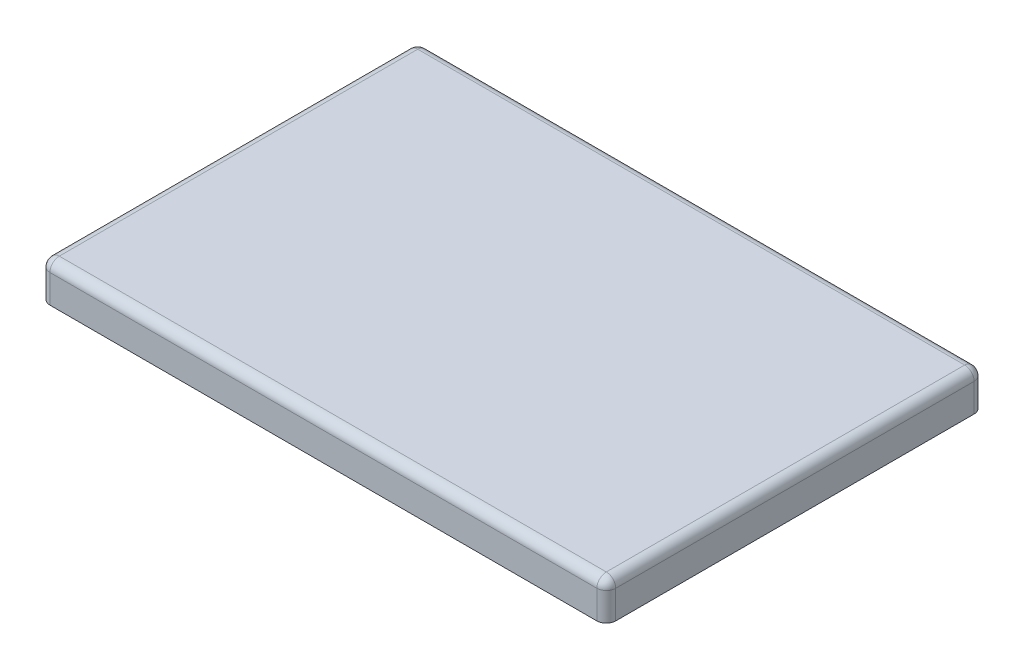
ISO-10303-21;
HEADER;
FILE_DESCRIPTION(('STEP AP214'),'2;1');
FILE_NAME('part.step','',(''),(''),'','','');
FILE_SCHEMA(('AUTOMOTIVE_DESIGN { 1 0 10303 214 1 1 1 1 }'));
ENDSEC;
DATA;
#1=APPLICATION_CONTEXT('core data for automotive mechanical design processes');
#2=APPLICATION_PROTOCOL_DEFINITION('international standard','automotive_design',2000,#1);
#3=PRODUCT_CONTEXT('',#1,'mechanical');
#4=PRODUCT('Part','Part','',(#3));
#5=PRODUCT_RELATED_PRODUCT_CATEGORY('part','',(#4));
#6=PRODUCT_DEFINITION_FORMATION('','',#4);
#7=PRODUCT_DEFINITION_CONTEXT('part definition',#1,'design');
#8=PRODUCT_DEFINITION('design','',#6,#7);
#9=PRODUCT_DEFINITION_SHAPE('','',#8);
#10=(LENGTH_UNIT() NAMED_UNIT(*) SI_UNIT(.MILLI.,.METRE.));
#11=(NAMED_UNIT(*) PLANE_ANGLE_UNIT() SI_UNIT($,.RADIAN.));
#12=(NAMED_UNIT(*) SI_UNIT($,.STERADIAN.) SOLID_ANGLE_UNIT());
#13=UNCERTAINTY_MEASURE_WITH_UNIT(LENGTH_MEASURE(1.E-05),#10,'distance_accuracy_value','');
#14=(GEOMETRIC_REPRESENTATION_CONTEXT(3) GLOBAL_UNCERTAINTY_ASSIGNED_CONTEXT((#13)) GLOBAL_UNIT_ASSIGNED_CONTEXT((#10,
#11,#12)) REPRESENTATION_CONTEXT('',''));
#15=CARTESIAN_POINT('',(0.,0.,0.));
#16=DIRECTION('',(0.,0.,1.));
#17=DIRECTION('',(1.,0.,0.));
#18=AXIS2_PLACEMENT_3D('',#15,#16,#17);
#19=CARTESIAN_POINT('',(-72.5,10.,47.5));
#20=DIRECTION('',(0.,-1.,0.));
#21=DIRECTION('',(0.,0.,-1.));
#22=AXIS2_PLACEMENT_3D('',#19,#20,#21);
#23=CYLINDRICAL_SURFACE('',#22,2.5);
#24=DIRECTION('',(0.,-1.,0.));
#25=VECTOR('',#24,1.);
#26=CARTESIAN_POINT('',(-72.5,10.,50.));
#27=LINE('',#26,#25);
#28=CARTESIAN_POINT('',(-72.5,7.5,50.));
#29=VERTEX_POINT('',#28);
#30=CARTESIAN_POINT('',(-72.5,0.,50.));
#31=VERTEX_POINT('',#30);
#32=EDGE_CURVE('E253',#29,#31,#27,.T.);
#33=ORIENTED_EDGE('',*,*,#32,.F.);
#34=CARTESIAN_POINT('',(-72.5,7.5,47.5));
#35=DIRECTION('',(0.,-1.,0.));
#36=DIRECTION('',(0.,0.,-1.));
#37=AXIS2_PLACEMENT_3D('',#34,#35,#36);
#38=CIRCLE('',#37,2.5);
#39=CARTESIAN_POINT('',(-75.,7.5,47.5));
#40=VERTEX_POINT('',#39);
#41=EDGE_CURVE('E279',#29,#40,#38,.T.);
#42=ORIENTED_EDGE('',*,*,#41,.T.);
#43=DIRECTION('',(0.,-1.,0.));
#44=VECTOR('',#43,1.);
#45=CARTESIAN_POINT('',(-75.,10.,47.5));
#46=LINE('',#45,#44);
#47=CARTESIAN_POINT('',(-75.,0.,47.5));
#48=VERTEX_POINT('',#47);
#49=EDGE_CURVE('E238',#40,#48,#46,.T.);
#50=ORIENTED_EDGE('',*,*,#49,.T.);
#51=CARTESIAN_POINT('',(-72.5,0.,47.5));
#52=DIRECTION('',(0.,1.,0.));
#53=DIRECTION('',(0.,0.,-1.));
#54=AXIS2_PLACEMENT_3D('',#51,#52,#53);
#55=CIRCLE('',#54,2.5);
#56=EDGE_CURVE('E186',#48,#31,#55,.T.);
#57=ORIENTED_EDGE('',*,*,#56,.T.);
#58=EDGE_LOOP('',(#33,#42,#50,#57));
#59=FACE_BOUND('',#58,.T.);
#60=ADVANCED_FACE('F33',(#59),#23,.T.);
#61=CARTESIAN_POINT('',(-72.5,10.,50.));
#62=DIRECTION('',(0.,0.,-1.));
#63=DIRECTION('',(-1.,0.,0.));
#64=AXIS2_PLACEMENT_3D('',#61,#62,#63);
#65=PLANE('',#64);
#66=DIRECTION('',(0.,-1.,0.));
#67=VECTOR('',#66,1.);
#68=CARTESIAN_POINT('',(72.5,10.,50.));
#69=LINE('',#68,#67);
#70=CARTESIAN_POINT('',(72.5,7.5,50.));
#71=VERTEX_POINT('',#70);
#72=CARTESIAN_POINT('',(72.5,0.,50.));
#73=VERTEX_POINT('',#72);
#74=EDGE_CURVE('E251',#71,#73,#69,.T.);
#75=ORIENTED_EDGE('',*,*,#74,.F.);
#76=DIRECTION('',(1.,0.,0.));
#77=VECTOR('',#76,1.);
#78=CARTESIAN_POINT('',(-72.5,7.5,50.));
#79=LINE('',#78,#77);
#80=EDGE_CURVE('E277',#71,#29,#79,.F.);
#81=ORIENTED_EDGE('',*,*,#80,.T.);
#82=ORIENTED_EDGE('',*,*,#32,.T.);
#83=DIRECTION('',(1.,0.,0.));
#84=VECTOR('',#83,1.);
#85=CARTESIAN_POINT('',(-72.5,0.,50.));
#86=LINE('',#85,#84);
#87=EDGE_CURVE('E190',#31,#73,#86,.T.);
#88=ORIENTED_EDGE('',*,*,#87,.T.);
#89=EDGE_LOOP('',(#75,#81,#82,#88));
#90=FACE_BOUND('',#89,.T.);
#91=ADVANCED_FACE('F439',(#90),#65,.F.);
#92=CARTESIAN_POINT('',(72.5,10.,47.5));
#93=DIRECTION('',(0.,-1.,0.));
#94=DIRECTION('',(0.,0.,-1.));
#95=AXIS2_PLACEMENT_3D('',#92,#93,#94);
#96=CYLINDRICAL_SURFACE('',#95,2.5);
#97=DIRECTION('',(0.,-1.,0.));
#98=VECTOR('',#97,1.);
#99=CARTESIAN_POINT('',(75.,10.,47.5));
#100=LINE('',#99,#98);
#101=CARTESIAN_POINT('',(75.,7.5,47.5));
#102=VERTEX_POINT('',#101);
#103=CARTESIAN_POINT('',(75.,0.,47.5));
#104=VERTEX_POINT('',#103);
#105=EDGE_CURVE('E249',#102,#104,#100,.T.);
#106=ORIENTED_EDGE('',*,*,#105,.F.);
#107=CARTESIAN_POINT('',(72.5,7.5,47.5));
#108=DIRECTION('',(0.,-1.,0.));
#109=DIRECTION('',(0.,0.,-1.));
#110=AXIS2_PLACEMENT_3D('',#107,#108,#109);
#111=CIRCLE('',#110,2.5);
#112=EDGE_CURVE('E275',#102,#71,#111,.T.);
#113=ORIENTED_EDGE('',*,*,#112,.T.);
#114=ORIENTED_EDGE('',*,*,#74,.T.);
#115=CARTESIAN_POINT('',(72.5,0.,47.5));
#116=DIRECTION('',(0.,1.,0.));
#117=DIRECTION('',(0.,0.,1.));
#118=AXIS2_PLACEMENT_3D('',#115,#116,#117);
#119=CIRCLE('',#118,2.5);
#120=EDGE_CURVE('E220',#73,#104,#119,.T.);
#121=ORIENTED_EDGE('',*,*,#120,.T.);
#122=EDGE_LOOP('',(#106,#113,#114,#121));
#123=FACE_BOUND('',#122,.T.);
#124=ADVANCED_FACE('F386',(#123),#96,.T.);
#125=CARTESIAN_POINT('',(75.,10.,47.5));
#126=DIRECTION('',(-1.,0.,0.));
#127=DIRECTION('',(0.,0.,1.));
#128=AXIS2_PLACEMENT_3D('',#125,#126,#127);
#129=PLANE('',#128);
#130=DIRECTION('',(0.,-1.,0.));
#131=VECTOR('',#130,1.);
#132=CARTESIAN_POINT('',(75.,10.,-47.5));
#133=LINE('',#132,#131);
#134=CARTESIAN_POINT('',(75.,7.5,-47.5));
#135=VERTEX_POINT('',#134);
#136=CARTESIAN_POINT('',(75.,0.,-47.5));
#137=VERTEX_POINT('',#136);
#138=EDGE_CURVE('E247',#135,#137,#133,.T.);
#139=ORIENTED_EDGE('',*,*,#138,.F.);
#140=DIRECTION('',(0.,0.,-1.));
#141=VECTOR('',#140,1.);
#142=CARTESIAN_POINT('',(75.,7.5,47.5));
#143=LINE('',#142,#141);
#144=EDGE_CURVE('E273',#135,#102,#143,.F.);
#145=ORIENTED_EDGE('',*,*,#144,.T.);
#146=ORIENTED_EDGE('',*,*,#105,.T.);
#147=DIRECTION('',(0.,0.,-1.));
#148=VECTOR('',#147,1.);
#149=CARTESIAN_POINT('',(75.,0.,47.5));
#150=LINE('',#149,#148);
#151=EDGE_CURVE('E223',#104,#137,#150,.T.);
#152=ORIENTED_EDGE('',*,*,#151,.T.);
#153=EDGE_LOOP('',(#139,#145,#146,#152));
#154=FACE_BOUND('',#153,.T.);
#155=ADVANCED_FACE('F382',(#154),#129,.F.);
#156=CARTESIAN_POINT('',(72.5,10.,-47.5));
#157=DIRECTION('',(0.,-1.,0.));
#158=DIRECTION('',(0.,0.,-1.));
#159=AXIS2_PLACEMENT_3D('',#156,#157,#158);
#160=CYLINDRICAL_SURFACE('',#159,2.5);
#161=DIRECTION('',(0.,-1.,0.));
#162=VECTOR('',#161,1.);
#163=CARTESIAN_POINT('',(72.5,10.,-50.));
#164=LINE('',#163,#162);
#165=CARTESIAN_POINT('',(72.5,7.5,-50.));
#166=VERTEX_POINT('',#165);
#167=CARTESIAN_POINT('',(72.5,0.,-50.));
#168=VERTEX_POINT('',#167);
#169=EDGE_CURVE('E245',#166,#168,#164,.T.);
#170=ORIENTED_EDGE('',*,*,#169,.F.);
#171=CARTESIAN_POINT('',(72.5,7.5,-47.5));
#172=DIRECTION('',(0.,-1.,0.));
#173=DIRECTION('',(0.,0.,-1.));
#174=AXIS2_PLACEMENT_3D('',#171,#172,#173);
#175=CIRCLE('',#174,2.5);
#176=EDGE_CURVE('E271',#166,#135,#175,.T.);
#177=ORIENTED_EDGE('',*,*,#176,.T.);
#178=ORIENTED_EDGE('',*,*,#138,.T.);
#179=CARTESIAN_POINT('',(72.5,0.,-47.5));
#180=DIRECTION('',(0.,1.,0.));
#181=DIRECTION('',(0.,0.,-1.));
#182=AXIS2_PLACEMENT_3D('',#179,#180,#181);
#183=CIRCLE('',#182,2.5);
#184=EDGE_CURVE('E226',#137,#168,#183,.T.);
#185=ORIENTED_EDGE('',*,*,#184,.T.);
#186=EDGE_LOOP('',(#170,#177,#178,#185));
#187=FACE_BOUND('',#186,.T.);
#188=ADVANCED_FACE('F378',(#187),#160,.T.);
#189=CARTESIAN_POINT('',(-72.5,10.,-50.));
#190=DIRECTION('',(0.,0.,1.));
#191=DIRECTION('',(1.,0.,0.));
#192=AXIS2_PLACEMENT_3D('',#189,#190,#191);
#193=PLANE('',#192);
#194=DIRECTION('',(0.,-1.,0.));
#195=VECTOR('',#194,1.);
#196=CARTESIAN_POINT('',(-72.5,10.,-50.));
#197=LINE('',#196,#195);
#198=CARTESIAN_POINT('',(-72.5,7.5,-50.));
#199=VERTEX_POINT('',#198);
#200=CARTESIAN_POINT('',(-72.5,0.,-50.));
#201=VERTEX_POINT('',#200);
#202=EDGE_CURVE('E243',#199,#201,#197,.T.);
#203=ORIENTED_EDGE('',*,*,#202,.F.);
#204=DIRECTION('',(-1.,0.,0.));
#205=VECTOR('',#204,1.);
#206=CARTESIAN_POINT('',(-72.5,7.5,-50.));
#207=LINE('',#206,#205);
#208=EDGE_CURVE('E269',#199,#166,#207,.F.);
#209=ORIENTED_EDGE('',*,*,#208,.T.);
#210=ORIENTED_EDGE('',*,*,#169,.T.);
#211=DIRECTION('',(-1.,0.,0.));
#212=VECTOR('',#211,1.);
#213=CARTESIAN_POINT('',(-72.5,0.,-50.));
#214=LINE('',#213,#212);
#215=EDGE_CURVE('E229',#168,#201,#214,.T.);
#216=ORIENTED_EDGE('',*,*,#215,.T.);
#217=EDGE_LOOP('',(#203,#209,#210,#216));
#218=FACE_BOUND('',#217,.T.);
#219=ADVANCED_FACE('F374',(#218),#193,.F.);
#220=CARTESIAN_POINT('',(-72.5,10.,-47.5));
#221=DIRECTION('',(0.,-1.,0.));
#222=DIRECTION('',(0.,0.,-1.));
#223=AXIS2_PLACEMENT_3D('',#220,#221,#222);
#224=CYLINDRICAL_SURFACE('',#223,2.5);
#225=DIRECTION('',(0.,-1.,0.));
#226=VECTOR('',#225,1.);
#227=CARTESIAN_POINT('',(-75.,10.,-47.5));
#228=LINE('',#227,#226);
#229=CARTESIAN_POINT('',(-75.,7.5,-47.5));
#230=VERTEX_POINT('',#229);
#231=CARTESIAN_POINT('',(-75.,0.,-47.5));
#232=VERTEX_POINT('',#231);
#233=EDGE_CURVE('E241',#230,#232,#228,.T.);
#234=ORIENTED_EDGE('',*,*,#233,.F.);
#235=CARTESIAN_POINT('',(-72.5,7.5,-47.5));
#236=DIRECTION('',(0.,-1.,0.));
#237=DIRECTION('',(0.,0.,-1.));
#238=AXIS2_PLACEMENT_3D('',#235,#236,#237);
#239=CIRCLE('',#238,2.5);
#240=EDGE_CURVE('E267',#230,#199,#239,.T.);
#241=ORIENTED_EDGE('',*,*,#240,.T.);
#242=ORIENTED_EDGE('',*,*,#202,.T.);
#243=CARTESIAN_POINT('',(-72.5,0.,-47.5));
#244=DIRECTION('',(0.,1.,0.));
#245=DIRECTION('',(0.,0.,-1.));
#246=AXIS2_PLACEMENT_3D('',#243,#244,#245);
#247=CIRCLE('',#246,2.5);
#248=EDGE_CURVE('E232',#201,#232,#247,.T.);
#249=ORIENTED_EDGE('',*,*,#248,.T.);
#250=EDGE_LOOP('',(#234,#241,#242,#249));
#251=FACE_BOUND('',#250,.T.);
#252=ADVANCED_FACE('F369',(#251),#224,.T.);
#253=CARTESIAN_POINT('',(-75.,10.,47.5));
#254=DIRECTION('',(1.,0.,0.));
#255=DIRECTION('',(0.,0.,-1.));
#256=AXIS2_PLACEMENT_3D('',#253,#254,#255);
#257=PLANE('',#256);
#258=ORIENTED_EDGE('',*,*,#49,.F.);
#259=DIRECTION('',(0.,0.,1.));
#260=VECTOR('',#259,1.);
#261=CARTESIAN_POINT('',(-75.,7.5,47.5));
#262=LINE('',#261,#260);
#263=EDGE_CURVE('E264',#40,#230,#262,.F.);
#264=ORIENTED_EDGE('',*,*,#263,.T.);
#265=ORIENTED_EDGE('',*,*,#233,.T.);
#266=DIRECTION('',(0.,0.,1.));
#267=VECTOR('',#266,1.);
#268=CARTESIAN_POINT('',(-75.,0.,47.5));
#269=LINE('',#268,#267);
#270=EDGE_CURVE('E235',#232,#48,#269,.T.);
#271=ORIENTED_EDGE('',*,*,#270,.T.);
#272=EDGE_LOOP('',(#258,#264,#265,#271));
#273=FACE_BOUND('',#272,.T.);
#274=ADVANCED_FACE('F404',(#273),#257,.F.);
#275=CARTESIAN_POINT('',(-72.5,10.,47.5));
#276=DIRECTION('',(0.,-1.,0.));
#277=DIRECTION('',(0.,0.,-1.));
#278=AXIS2_PLACEMENT_3D('',#275,#276,#277);
#279=PLANE('',#278);
#280=DIRECTION('',(-1.,0.,0.));
#281=VECTOR('',#280,1.);
#282=CARTESIAN_POINT('',(-72.5,10.,-47.5));
#283=LINE('',#282,#281);
#284=CARTESIAN_POINT('',(72.5,10.,-47.5));
#285=VERTEX_POINT('',#284);
#286=CARTESIAN_POINT('',(-72.5,10.,-47.5));
#287=VERTEX_POINT('',#286);
#288=EDGE_CURVE('E259',#285,#287,#283,.T.);
#289=ORIENTED_EDGE('',*,*,#288,.T.);
#290=DIRECTION('',(0.,0.,1.));
#291=VECTOR('',#290,1.);
#292=CARTESIAN_POINT('',(-72.5,10.,47.5));
#293=LINE('',#292,#291);
#294=CARTESIAN_POINT('',(-72.5,10.,47.5));
#295=VERTEX_POINT('',#294);
#296=EDGE_CURVE('E261',#287,#295,#293,.T.);
#297=ORIENTED_EDGE('',*,*,#296,.T.);
#298=DIRECTION('',(1.,0.,0.));
#299=VECTOR('',#298,1.);
#300=CARTESIAN_POINT('',(-72.5,10.,47.5));
#301=LINE('',#300,#299);
#302=CARTESIAN_POINT('',(72.5,10.,47.5));
#303=VERTEX_POINT('',#302);
#304=EDGE_CURVE('E255',#295,#303,#301,.T.);
#305=ORIENTED_EDGE('',*,*,#304,.T.);
#306=DIRECTION('',(0.,0.,-1.));
#307=VECTOR('',#306,1.);
#308=CARTESIAN_POINT('',(72.5,10.,47.5));
#309=LINE('',#308,#307);
#310=EDGE_CURVE('E257',#303,#285,#309,.T.);
#311=ORIENTED_EDGE('',*,*,#310,.T.);
#312=EDGE_LOOP('',(#289,#297,#305,#311));
#313=FACE_BOUND('',#312,.T.);
#314=ADVANCED_FACE('F422',(#313),#279,.F.);
#315=CARTESIAN_POINT('',(-72.5,10.,47.5));
#316=DIRECTION('',(0.,-1.,0.));
#317=DIRECTION('',(0.,0.,-1.));
#318=AXIS2_PLACEMENT_3D('',#315,#316,#317);
#319=CYLINDRICAL_SURFACE('',#318,1.25);
#320=DIRECTION('',(0.,1.,0.));
#321=VECTOR('',#320,1.);
#322=CARTESIAN_POINT('',(-72.5,10.,48.75));
#323=LINE('',#322,#321);
#324=CARTESIAN_POINT('',(-72.5,8.75,48.75));
#325=VERTEX_POINT('',#324);
#326=CARTESIAN_POINT('',(-72.5,1.24999999999995,48.75));
#327=VERTEX_POINT('',#326);
#328=EDGE_CURVE('E177',#325,#327,#323,.F.);
#329=ORIENTED_EDGE('',*,*,#328,.T.);
#330=CARTESIAN_POINT('',(-72.5,1.24999999999995,47.5));
#331=DIRECTION('',(0.,-1.,0.));
#332=DIRECTION('',(0.,0.,-1.));
#333=AXIS2_PLACEMENT_3D('',#330,#331,#332);
#334=CIRCLE('',#333,1.25);
#335=CARTESIAN_POINT('',(-73.75,1.24999999999995,47.5));
#336=VERTEX_POINT('',#335);
#337=EDGE_CURVE('E307',#327,#336,#334,.T.);
#338=ORIENTED_EDGE('',*,*,#337,.T.);
#339=DIRECTION('',(0.,-1.,0.));
#340=VECTOR('',#339,1.);
#341=CARTESIAN_POINT('',(-73.75,10.,47.5));
#342=LINE('',#341,#340);
#343=CARTESIAN_POINT('',(-73.75,8.75,47.5));
#344=VERTEX_POINT('',#343);
#345=EDGE_CURVE('E180',#344,#336,#342,.T.);
#346=ORIENTED_EDGE('',*,*,#345,.F.);
#347=CARTESIAN_POINT('',(-72.5,8.75,47.5));
#348=DIRECTION('',(0.,-1.,0.));
#349=DIRECTION('',(0.,0.,-1.));
#350=AXIS2_PLACEMENT_3D('',#347,#348,#349);
#351=CIRCLE('',#350,1.25);
#352=EDGE_CURVE('E165',#344,#325,#351,.F.);
#353=ORIENTED_EDGE('',*,*,#352,.T.);
#354=EDGE_LOOP('',(#329,#338,#346,#353));
#355=FACE_BOUND('',#354,.T.);
#356=ADVANCED_FACE('F176',(#355),#319,.F.);
#357=CARTESIAN_POINT('',(-72.5,10.,48.75));
#358=DIRECTION('',(0.,0.,-1.));
#359=DIRECTION('',(-1.,0.,0.));
#360=AXIS2_PLACEMENT_3D('',#357,#358,#359);
#361=PLANE('',#360);
#362=DIRECTION('',(0.,-1.,0.));
#363=VECTOR('',#362,1.);
#364=CARTESIAN_POINT('',(72.5,10.,48.75));
#365=LINE('',#364,#363);
#366=CARTESIAN_POINT('',(72.5,8.75,48.75));
#367=VERTEX_POINT('',#366);
#368=CARTESIAN_POINT('',(72.5,1.24999999999995,48.75));
#369=VERTEX_POINT('',#368);
#370=EDGE_CURVE('E187',#367,#369,#365,.T.);
#371=ORIENTED_EDGE('',*,*,#370,.T.);
#372=DIRECTION('',(-1.,0.,0.));
#373=VECTOR('',#372,1.);
#374=CARTESIAN_POINT('',(-72.5,1.24999999999995,48.75));
#375=LINE('',#374,#373);
#376=EDGE_CURVE('E185',#369,#327,#375,.T.);
#377=ORIENTED_EDGE('',*,*,#376,.T.);
#378=ORIENTED_EDGE('',*,*,#328,.F.);
#379=DIRECTION('',(1.,0.,0.));
#380=VECTOR('',#379,1.);
#381=CARTESIAN_POINT('',(-72.5,8.75,48.75));
#382=LINE('',#381,#380);
#383=EDGE_CURVE('E161',#325,#367,#382,.T.);
#384=ORIENTED_EDGE('',*,*,#383,.T.);
#385=EDGE_LOOP('',(#371,#377,#378,#384));
#386=FACE_BOUND('',#385,.T.);
#387=ADVANCED_FACE('F183',(#386),#361,.T.);
#388=CARTESIAN_POINT('',(72.5,10.,47.5));
#389=DIRECTION('',(0.,-1.,0.));
#390=DIRECTION('',(0.,0.,-1.));
#391=AXIS2_PLACEMENT_3D('',#388,#389,#390);
#392=CYLINDRICAL_SURFACE('',#391,1.25);
#393=DIRECTION('',(0.,1.,0.));
#394=VECTOR('',#393,1.);
#395=CARTESIAN_POINT('',(73.75,10.,47.5));
#396=LINE('',#395,#394);
#397=CARTESIAN_POINT('',(73.75,8.75,47.5));
#398=VERTEX_POINT('',#397);
#399=CARTESIAN_POINT('',(73.75,1.24999999999995,47.5));
#400=VERTEX_POINT('',#399);
#401=EDGE_CURVE('E192',#398,#400,#396,.F.);
#402=ORIENTED_EDGE('',*,*,#401,.T.);
#403=CARTESIAN_POINT('',(72.5,1.24999999999995,47.5));
#404=DIRECTION('',(0.,-1.,0.));
#405=DIRECTION('',(0.,0.,-1.));
#406=AXIS2_PLACEMENT_3D('',#403,#404,#405);
#407=CIRCLE('',#406,1.25);
#408=EDGE_CURVE('E11',#400,#369,#407,.T.);
#409=ORIENTED_EDGE('',*,*,#408,.T.);
#410=ORIENTED_EDGE('',*,*,#370,.F.);
#411=CARTESIAN_POINT('',(72.5,8.75,47.5));
#412=DIRECTION('',(0.,-1.,0.));
#413=DIRECTION('',(0.,0.,-1.));
#414=AXIS2_PLACEMENT_3D('',#411,#412,#413);
#415=CIRCLE('',#414,1.25);
#416=EDGE_CURVE('E167',#367,#398,#415,.F.);
#417=ORIENTED_EDGE('',*,*,#416,.T.);
#418=EDGE_LOOP('',(#402,#409,#410,#417));
#419=FACE_BOUND('',#418,.T.);
#420=ADVANCED_FACE('F346',(#419),#392,.F.);
#421=CARTESIAN_POINT('',(73.75,10.,47.5));
#422=DIRECTION('',(-1.,0.,0.));
#423=DIRECTION('',(0.,0.,1.));
#424=AXIS2_PLACEMENT_3D('',#421,#422,#423);
#425=PLANE('',#424);
#426=DIRECTION('',(0.,-1.,0.));
#427=VECTOR('',#426,1.);
#428=CARTESIAN_POINT('',(73.75,10.,-47.5));
#429=LINE('',#428,#427);
#430=CARTESIAN_POINT('',(73.75,8.75,-47.5));
#431=VERTEX_POINT('',#430);
#432=CARTESIAN_POINT('',(73.75,1.24999999999995,-47.5));
#433=VERTEX_POINT('',#432);
#434=EDGE_CURVE('E199',#431,#433,#429,.T.);
#435=ORIENTED_EDGE('',*,*,#434,.T.);
#436=DIRECTION('',(0.,0.,1.));
#437=VECTOR('',#436,1.);
#438=CARTESIAN_POINT('',(73.75,1.24999999999995,47.5));
#439=LINE('',#438,#437);
#440=EDGE_CURVE('E42',#433,#400,#439,.T.);
#441=ORIENTED_EDGE('',*,*,#440,.T.);
#442=ORIENTED_EDGE('',*,*,#401,.F.);
#443=DIRECTION('',(0.,0.,-1.));
#444=VECTOR('',#443,1.);
#445=CARTESIAN_POINT('',(73.75,8.75,47.5));
#446=LINE('',#445,#444);
#447=EDGE_CURVE('E201',#398,#431,#446,.T.);
#448=ORIENTED_EDGE('',*,*,#447,.T.);
#449=EDGE_LOOP('',(#435,#441,#442,#448));
#450=FACE_BOUND('',#449,.T.);
#451=ADVANCED_FACE('F347',(#450),#425,.T.);
#452=CARTESIAN_POINT('',(72.5,10.,-47.5));
#453=DIRECTION('',(0.,-1.,0.));
#454=DIRECTION('',(0.,0.,-1.));
#455=AXIS2_PLACEMENT_3D('',#452,#453,#454);
#456=CYLINDRICAL_SURFACE('',#455,1.25);
#457=DIRECTION('',(0.,1.,0.));
#458=VECTOR('',#457,1.);
#459=CARTESIAN_POINT('',(72.5,10.,-48.75));
#460=LINE('',#459,#458);
#461=CARTESIAN_POINT('',(72.5,8.75,-48.75));
#462=VERTEX_POINT('',#461);
#463=CARTESIAN_POINT('',(72.5,1.24999999999995,-48.75));
#464=VERTEX_POINT('',#463);
#465=EDGE_CURVE('E203',#462,#464,#460,.F.);
#466=ORIENTED_EDGE('',*,*,#465,.T.);
#467=CARTESIAN_POINT('',(72.5,1.24999999999995,-47.5));
#468=DIRECTION('',(0.,-1.,0.));
#469=DIRECTION('',(0.,0.,-1.));
#470=AXIS2_PLACEMENT_3D('',#467,#468,#469);
#471=CIRCLE('',#470,1.25);
#472=EDGE_CURVE('E57',#464,#433,#471,.T.);
#473=ORIENTED_EDGE('',*,*,#472,.T.);
#474=ORIENTED_EDGE('',*,*,#434,.F.);
#475=CARTESIAN_POINT('',(72.5,8.75,-47.5));
#476=DIRECTION('',(0.,-1.,0.));
#477=DIRECTION('',(0.,0.,-1.));
#478=AXIS2_PLACEMENT_3D('',#475,#476,#477);
#479=CIRCLE('',#478,1.25);
#480=EDGE_CURVE('E205',#431,#462,#479,.F.);
#481=ORIENTED_EDGE('',*,*,#480,.T.);
#482=EDGE_LOOP('',(#466,#473,#474,#481));
#483=FACE_BOUND('',#482,.T.);
#484=ADVANCED_FACE('F352',(#483),#456,.F.);
#485=CARTESIAN_POINT('',(-72.5,10.,-48.75));
#486=DIRECTION('',(0.,0.,1.));
#487=DIRECTION('',(1.,0.,0.));
#488=AXIS2_PLACEMENT_3D('',#485,#486,#487);
#489=PLANE('',#488);
#490=DIRECTION('',(0.,-1.,0.));
#491=VECTOR('',#490,1.);
#492=CARTESIAN_POINT('',(-72.5,10.,-48.75));
#493=LINE('',#492,#491);
#494=CARTESIAN_POINT('',(-72.5,8.75,-48.75));
#495=VERTEX_POINT('',#494);
#496=CARTESIAN_POINT('',(-72.5,1.24999999999995,-48.75));
#497=VERTEX_POINT('',#496);
#498=EDGE_CURVE('E207',#495,#497,#493,.T.);
#499=ORIENTED_EDGE('',*,*,#498,.T.);
#500=DIRECTION('',(1.,0.,0.));
#501=VECTOR('',#500,1.);
#502=CARTESIAN_POINT('',(-72.5,1.24999999999995,-48.75));
#503=LINE('',#502,#501);
#504=EDGE_CURVE('E309',#497,#464,#503,.T.);
#505=ORIENTED_EDGE('',*,*,#504,.T.);
#506=ORIENTED_EDGE('',*,*,#465,.F.);
#507=DIRECTION('',(-1.,0.,0.));
#508=VECTOR('',#507,1.);
#509=CARTESIAN_POINT('',(-72.5,8.75,-48.75));
#510=LINE('',#509,#508);
#511=EDGE_CURVE('E209',#462,#495,#510,.T.);
#512=ORIENTED_EDGE('',*,*,#511,.T.);
#513=EDGE_LOOP('',(#499,#505,#506,#512));
#514=FACE_BOUND('',#513,.T.);
#515=ADVANCED_FACE('F354',(#514),#489,.T.);
#516=CARTESIAN_POINT('',(-72.5,10.,-47.5));
#517=DIRECTION('',(0.,-1.,0.));
#518=DIRECTION('',(0.,0.,-1.));
#519=AXIS2_PLACEMENT_3D('',#516,#517,#518);
#520=CYLINDRICAL_SURFACE('',#519,1.25);
#521=DIRECTION('',(0.,1.,0.));
#522=VECTOR('',#521,1.);
#523=CARTESIAN_POINT('',(-73.75,10.,-47.5));
#524=LINE('',#523,#522);
#525=CARTESIAN_POINT('',(-73.75,8.75,-47.5));
#526=VERTEX_POINT('',#525);
#527=CARTESIAN_POINT('',(-73.75,1.24999999999995,-47.5));
#528=VERTEX_POINT('',#527);
#529=EDGE_CURVE('E195',#526,#528,#524,.F.);
#530=ORIENTED_EDGE('',*,*,#529,.T.);
#531=CARTESIAN_POINT('',(-72.5,1.24999999999995,-47.5));
#532=DIRECTION('',(0.,-1.,0.));
#533=DIRECTION('',(0.,0.,-1.));
#534=AXIS2_PLACEMENT_3D('',#531,#532,#533);
#535=CIRCLE('',#534,1.25);
#536=EDGE_CURVE('E305',#528,#497,#535,.T.);
#537=ORIENTED_EDGE('',*,*,#536,.T.);
#538=ORIENTED_EDGE('',*,*,#498,.F.);
#539=CARTESIAN_POINT('',(-72.5,8.75,-47.5));
#540=DIRECTION('',(0.,-1.,0.));
#541=DIRECTION('',(0.,0.,-1.));
#542=AXIS2_PLACEMENT_3D('',#539,#540,#541);
#543=CIRCLE('',#542,1.25);
#544=EDGE_CURVE('E213',#495,#526,#543,.F.);
#545=ORIENTED_EDGE('',*,*,#544,.T.);
#546=EDGE_LOOP('',(#530,#537,#538,#545));
#547=FACE_BOUND('',#546,.T.);
#548=ADVANCED_FACE('F616',(#547),#520,.F.);
#549=CARTESIAN_POINT('',(-73.75,10.,47.5));
#550=DIRECTION('',(1.,0.,0.));
#551=DIRECTION('',(0.,0.,-1.));
#552=AXIS2_PLACEMENT_3D('',#549,#550,#551);
#553=PLANE('',#552);
#554=ORIENTED_EDGE('',*,*,#345,.T.);
#555=DIRECTION('',(0.,0.,-1.));
#556=VECTOR('',#555,1.);
#557=CARTESIAN_POINT('',(-73.75,1.24999999999995,47.5));
#558=LINE('',#557,#556);
#559=EDGE_CURVE('E281',#336,#528,#558,.T.);
#560=ORIENTED_EDGE('',*,*,#559,.T.);
#561=ORIENTED_EDGE('',*,*,#529,.F.);
#562=DIRECTION('',(0.,0.,1.));
#563=VECTOR('',#562,1.);
#564=CARTESIAN_POINT('',(-73.75,8.75,47.5));
#565=LINE('',#564,#563);
#566=EDGE_CURVE('E196',#526,#344,#565,.T.);
#567=ORIENTED_EDGE('',*,*,#566,.T.);
#568=EDGE_LOOP('',(#554,#560,#561,#567));
#569=FACE_BOUND('',#568,.T.);
#570=ADVANCED_FACE('F398',(#569),#553,.T.);
#571=CARTESIAN_POINT('',(-72.5,8.75,47.5));
#572=DIRECTION('',(0.,-1.,0.));
#573=DIRECTION('',(0.,0.,-1.));
#574=AXIS2_PLACEMENT_3D('',#571,#572,#573);
#575=PLANE('',#574);
#576=ORIENTED_EDGE('',*,*,#352,.F.);
#577=ORIENTED_EDGE('',*,*,#566,.F.);
#578=ORIENTED_EDGE('',*,*,#544,.F.);
#579=ORIENTED_EDGE('',*,*,#511,.F.);
#580=ORIENTED_EDGE('',*,*,#480,.F.);
#581=ORIENTED_EDGE('',*,*,#447,.F.);
#582=ORIENTED_EDGE('',*,*,#416,.F.);
#583=ORIENTED_EDGE('',*,*,#383,.F.);
#584=EDGE_LOOP('',(#576,#577,#578,#579,#580,#581,#582,#583));
#585=FACE_BOUND('',#584,.T.);
#586=ADVANCED_FACE('F163',(#585),#575,.T.);
#587=CARTESIAN_POINT('',(72.5,7.5,47.5));
#588=DIRECTION('',(0.,0.,-1.));
#589=DIRECTION('',(-1.,0.,0.));
#590=AXIS2_PLACEMENT_3D('',#587,#588,#589);
#591=CYLINDRICAL_SURFACE('',#590,2.5);
#592=CARTESIAN_POINT('',(72.5,7.5,47.5));
#593=DIRECTION('',(0.,0.,1.));
#594=DIRECTION('',(1.,0.,0.));
#595=AXIS2_PLACEMENT_3D('',#592,#593,#594);
#596=CIRCLE('',#595,2.5);
#597=EDGE_CURVE('E298',#102,#303,#596,.T.);
#598=ORIENTED_EDGE('',*,*,#597,.F.);
#599=ORIENTED_EDGE('',*,*,#144,.F.);
#600=CARTESIAN_POINT('',(72.5,7.5,-47.5));
#601=DIRECTION('',(0.,0.,-1.));
#602=DIRECTION('',(-1.,0.,0.));
#603=AXIS2_PLACEMENT_3D('',#600,#601,#602);
#604=CIRCLE('',#603,2.5);
#605=EDGE_CURVE('E181',#285,#135,#604,.T.);
#606=ORIENTED_EDGE('',*,*,#605,.F.);
#607=ORIENTED_EDGE('',*,*,#310,.F.);
#608=EDGE_LOOP('',(#598,#599,#606,#607));
#609=FACE_BOUND('',#608,.T.);
#610=ADVANCED_FACE('F472',(#609),#591,.T.);
#611=CARTESIAN_POINT('',(72.5,7.5,-47.5));
#612=DIRECTION('',(0.,0.,1.));
#613=DIRECTION('',(1.,0.,0.));
#614=AXIS2_PLACEMENT_3D('',#611,#612,#613);
#615=SPHERICAL_SURFACE('',#614,2.5);
#616=ORIENTED_EDGE('',*,*,#605,.T.);
#617=ORIENTED_EDGE('',*,*,#176,.F.);
#618=CARTESIAN_POINT('',(72.5,7.5,-47.5));
#619=DIRECTION('',(-1.,0.,0.));
#620=DIRECTION('',(0.,0.,1.));
#621=AXIS2_PLACEMENT_3D('',#618,#619,#620);
#622=CIRCLE('',#621,2.5);
#623=EDGE_CURVE('E295',#285,#166,#622,.T.);
#624=ORIENTED_EDGE('',*,*,#623,.F.);
#625=EDGE_LOOP('',(#616,#617,#624));
#626=FACE_BOUND('',#625,.T.);
#627=ADVANCED_FACE('F475',(#626),#615,.T.);
#628=CARTESIAN_POINT('',(72.5,7.5,47.5));
#629=DIRECTION('',(0.,0.,1.));
#630=DIRECTION('',(1.,0.,0.));
#631=AXIS2_PLACEMENT_3D('',#628,#629,#630);
#632=SPHERICAL_SURFACE('',#631,2.5);
#633=ORIENTED_EDGE('',*,*,#112,.F.);
#634=ORIENTED_EDGE('',*,*,#597,.T.);
#635=CARTESIAN_POINT('',(72.5,7.5,47.5));
#636=DIRECTION('',(-1.,0.,0.));
#637=DIRECTION('',(0.,0.,1.));
#638=AXIS2_PLACEMENT_3D('',#635,#636,#637);
#639=CIRCLE('',#638,2.5);
#640=EDGE_CURVE('E292',#71,#303,#639,.T.);
#641=ORIENTED_EDGE('',*,*,#640,.F.);
#642=EDGE_LOOP('',(#633,#634,#641));
#643=FACE_BOUND('',#642,.T.);
#644=ADVANCED_FACE('F479',(#643),#632,.T.);
#645=CARTESIAN_POINT('',(-72.5,7.5,-47.5));
#646=DIRECTION('',(-1.,0.,0.));
#647=DIRECTION('',(0.,0.,1.));
#648=AXIS2_PLACEMENT_3D('',#645,#646,#647);
#649=CYLINDRICAL_SURFACE('',#648,2.5);
#650=ORIENTED_EDGE('',*,*,#623,.T.);
#651=ORIENTED_EDGE('',*,*,#208,.F.);
#652=CARTESIAN_POINT('',(-72.5,7.5,-47.5));
#653=DIRECTION('',(-1.,0.,0.));
#654=DIRECTION('',(0.,0.,1.));
#655=AXIS2_PLACEMENT_3D('',#652,#653,#654);
#656=CIRCLE('',#655,2.5);
#657=EDGE_CURVE('E289',#287,#199,#656,.T.);
#658=ORIENTED_EDGE('',*,*,#657,.F.);
#659=ORIENTED_EDGE('',*,*,#288,.F.);
#660=EDGE_LOOP('',(#650,#651,#658,#659));
#661=FACE_BOUND('',#660,.T.);
#662=ADVANCED_FACE('F427',(#661),#649,.T.);
#663=CARTESIAN_POINT('',(-72.5,7.5,47.5));
#664=DIRECTION('',(1.,0.,0.));
#665=DIRECTION('',(0.,0.,-1.));
#666=AXIS2_PLACEMENT_3D('',#663,#664,#665);
#667=CYLINDRICAL_SURFACE('',#666,2.5);
#668=ORIENTED_EDGE('',*,*,#640,.T.);
#669=ORIENTED_EDGE('',*,*,#304,.F.);
#670=CARTESIAN_POINT('',(-72.5,7.5,47.5));
#671=DIRECTION('',(-1.,0.,0.));
#672=DIRECTION('',(0.,0.,1.));
#673=AXIS2_PLACEMENT_3D('',#670,#671,#672);
#674=CIRCLE('',#673,2.5);
#675=EDGE_CURVE('E286',#29,#295,#674,.T.);
#676=ORIENTED_EDGE('',*,*,#675,.F.);
#677=ORIENTED_EDGE('',*,*,#80,.F.);
#678=EDGE_LOOP('',(#668,#669,#676,#677));
#679=FACE_BOUND('',#678,.T.);
#680=ADVANCED_FACE('F418',(#679),#667,.T.);
#681=CARTESIAN_POINT('',(-72.5,7.5,-47.5));
#682=DIRECTION('',(0.,0.,1.));
#683=DIRECTION('',(1.,0.,0.));
#684=AXIS2_PLACEMENT_3D('',#681,#682,#683);
#685=SPHERICAL_SURFACE('',#684,2.5);
#686=ORIENTED_EDGE('',*,*,#657,.T.);
#687=ORIENTED_EDGE('',*,*,#240,.F.);
#688=CARTESIAN_POINT('',(-72.5,7.5,-47.5));
#689=DIRECTION('',(0.,0.,1.));
#690=DIRECTION('',(1.,0.,0.));
#691=AXIS2_PLACEMENT_3D('',#688,#689,#690);
#692=CIRCLE('',#691,2.5);
#693=EDGE_CURVE('E284',#287,#230,#692,.T.);
#694=ORIENTED_EDGE('',*,*,#693,.F.);
#695=EDGE_LOOP('',(#686,#687,#694));
#696=FACE_BOUND('',#695,.T.);
#697=ADVANCED_FACE('F429',(#696),#685,.T.);
#698=CARTESIAN_POINT('',(-72.5,7.5,47.5));
#699=DIRECTION('',(0.,0.,1.));
#700=DIRECTION('',(1.,0.,0.));
#701=AXIS2_PLACEMENT_3D('',#698,#699,#700);
#702=SPHERICAL_SURFACE('',#701,2.5);
#703=ORIENTED_EDGE('',*,*,#41,.F.);
#704=ORIENTED_EDGE('',*,*,#675,.T.);
#705=CARTESIAN_POINT('',(-72.5,7.5,47.5));
#706=DIRECTION('',(0.,0.,-1.));
#707=DIRECTION('',(-1.,0.,0.));
#708=AXIS2_PLACEMENT_3D('',#705,#706,#707);
#709=CIRCLE('',#708,2.5);
#710=EDGE_CURVE('E282',#40,#295,#709,.T.);
#711=ORIENTED_EDGE('',*,*,#710,.F.);
#712=EDGE_LOOP('',(#703,#704,#711));
#713=FACE_BOUND('',#712,.T.);
#714=ADVANCED_FACE('F413',(#713),#702,.T.);
#715=CARTESIAN_POINT('',(-72.5,7.5,47.5));
#716=DIRECTION('',(0.,0.,1.));
#717=DIRECTION('',(1.,0.,0.));
#718=AXIS2_PLACEMENT_3D('',#715,#716,#717);
#719=CYLINDRICAL_SURFACE('',#718,2.5);
#720=ORIENTED_EDGE('',*,*,#693,.T.);
#721=ORIENTED_EDGE('',*,*,#263,.F.);
#722=ORIENTED_EDGE('',*,*,#710,.T.);
#723=ORIENTED_EDGE('',*,*,#296,.F.);
#724=EDGE_LOOP('',(#720,#721,#722,#723));
#725=FACE_BOUND('',#724,.T.);
#726=ADVANCED_FACE('F408',(#725),#719,.T.);
#727=CARTESIAN_POINT('',(75.,0.,47.5));
#728=DIRECTION('',(0.707106781186537,0.707106781186558,0.));
#729=DIRECTION('',(-0.707106781186558,0.707106781186537,0.));
#730=AXIS2_PLACEMENT_3D('',#727,#728,#729);
#731=PLANE('',#730);
#732=DIRECTION('',(0.707106781186558,-0.707106781186537,0.));
#733=VECTOR('',#732,1.);
#734=CARTESIAN_POINT('',(73.75,1.24999999999995,47.5));
#735=LINE('',#734,#733);
#736=EDGE_CURVE('E329',#400,#104,#735,.T.);
#737=ORIENTED_EDGE('',*,*,#736,.F.);
#738=ORIENTED_EDGE('',*,*,#440,.F.);
#739=DIRECTION('',(-0.707106781186558,0.707106781186537,0.));
#740=VECTOR('',#739,1.);
#741=CARTESIAN_POINT('',(75.,0.,-47.5));
#742=LINE('',#741,#740);
#743=EDGE_CURVE('E37',#137,#433,#742,.T.);
#744=ORIENTED_EDGE('',*,*,#743,.F.);
#745=ORIENTED_EDGE('',*,*,#151,.F.);
#746=EDGE_LOOP('',(#737,#738,#744,#745));
#747=FACE_BOUND('',#746,.T.);
#748=ADVANCED_FACE('F35',(#747),#731,.F.);
#749=CARTESIAN_POINT('',(72.5,0.,-47.5));
#750=DIRECTION('',(0.,-1.,0.));
#751=DIRECTION('',(0.,0.,-1.));
#752=AXIS2_PLACEMENT_3D('',#749,#750,#751);
#753=CONICAL_SURFACE('',#752,2.49999999999999,0.785398163397463);
#754=ORIENTED_EDGE('',*,*,#743,.T.);
#755=ORIENTED_EDGE('',*,*,#472,.F.);
#756=DIRECTION('',(0.,0.707106781186537,0.707106781186558));
#757=VECTOR('',#756,1.);
#758=CARTESIAN_POINT('',(72.5,0.,-50.));
#759=LINE('',#758,#757);
#760=EDGE_CURVE('E327',#168,#464,#759,.T.);
#761=ORIENTED_EDGE('',*,*,#760,.F.);
#762=ORIENTED_EDGE('',*,*,#184,.F.);
#763=EDGE_LOOP('',(#754,#755,#761,#762));
#764=FACE_BOUND('',#763,.T.);
#765=ADVANCED_FACE('F339',(#764),#753,.F.);
#766=CARTESIAN_POINT('',(72.5,0.,47.5));
#767=DIRECTION('',(0.,-1.,0.));
#768=DIRECTION('',(0.,0.,-1.));
#769=AXIS2_PLACEMENT_3D('',#766,#767,#768);
#770=CONICAL_SURFACE('',#769,2.49999999999999,0.785398163397463);
#771=ORIENTED_EDGE('',*,*,#736,.T.);
#772=ORIENTED_EDGE('',*,*,#120,.F.);
#773=DIRECTION('',(0.,-0.707106781186537,0.707106781186558));
#774=VECTOR('',#773,1.);
#775=CARTESIAN_POINT('',(72.5,1.24999999999995,48.75));
#776=LINE('',#775,#774);
#777=EDGE_CURVE('E324',#369,#73,#776,.T.);
#778=ORIENTED_EDGE('',*,*,#777,.F.);
#779=ORIENTED_EDGE('',*,*,#408,.F.);
#780=EDGE_LOOP('',(#771,#772,#778,#779));
#781=FACE_BOUND('',#780,.T.);
#782=ADVANCED_FACE('F344',(#781),#770,.F.);
#783=CARTESIAN_POINT('',(-72.5,0.,-50.));
#784=DIRECTION('',(0.,0.707106781186558,-0.707106781186537));
#785=DIRECTION('',(0.,0.707106781186537,0.707106781186558));
#786=AXIS2_PLACEMENT_3D('',#783,#784,#785);
#787=PLANE('',#786);
#788=ORIENTED_EDGE('',*,*,#760,.T.);
#789=ORIENTED_EDGE('',*,*,#504,.F.);
#790=DIRECTION('',(0.,0.707106781186537,0.707106781186558));
#791=VECTOR('',#790,1.);
#792=CARTESIAN_POINT('',(-72.5,0.,-50.));
#793=LINE('',#792,#791);
#794=EDGE_CURVE('E321',#201,#497,#793,.T.);
#795=ORIENTED_EDGE('',*,*,#794,.F.);
#796=ORIENTED_EDGE('',*,*,#215,.F.);
#797=EDGE_LOOP('',(#788,#789,#795,#796));
#798=FACE_BOUND('',#797,.T.);
#799=ADVANCED_FACE('F359',(#798),#787,.F.);
#800=CARTESIAN_POINT('',(-72.5,0.,50.));
#801=DIRECTION('',(0.,0.707106781186558,0.707106781186537));
#802=DIRECTION('',(0.,-0.707106781186537,0.707106781186558));
#803=AXIS2_PLACEMENT_3D('',#800,#801,#802);
#804=PLANE('',#803);
#805=ORIENTED_EDGE('',*,*,#777,.T.);
#806=ORIENTED_EDGE('',*,*,#87,.F.);
#807=DIRECTION('',(0.,-0.707106781186537,0.707106781186558));
#808=VECTOR('',#807,1.);
#809=CARTESIAN_POINT('',(-72.5,1.24999999999995,48.75));
#810=LINE('',#809,#808);
#811=EDGE_CURVE('E318',#327,#31,#810,.T.);
#812=ORIENTED_EDGE('',*,*,#811,.F.);
#813=ORIENTED_EDGE('',*,*,#376,.F.);
#814=EDGE_LOOP('',(#805,#806,#812,#813));
#815=FACE_BOUND('',#814,.T.);
#816=ADVANCED_FACE('F390',(#815),#804,.F.);
#817=CARTESIAN_POINT('',(-72.5,0.,-47.5));
#818=DIRECTION('',(0.,-1.,0.));
#819=DIRECTION('',(0.,0.,-1.));
#820=AXIS2_PLACEMENT_3D('',#817,#818,#819);
#821=CONICAL_SURFACE('',#820,2.49999999999999,0.785398163397463);
#822=ORIENTED_EDGE('',*,*,#794,.T.);
#823=ORIENTED_EDGE('',*,*,#536,.F.);
#824=DIRECTION('',(0.707106781186558,0.707106781186537,0.));
#825=VECTOR('',#824,1.);
#826=CARTESIAN_POINT('',(-75.,0.,-47.5));
#827=LINE('',#826,#825);
#828=EDGE_CURVE('E316',#232,#528,#827,.T.);
#829=ORIENTED_EDGE('',*,*,#828,.F.);
#830=ORIENTED_EDGE('',*,*,#248,.F.);
#831=EDGE_LOOP('',(#822,#823,#829,#830));
#832=FACE_BOUND('',#831,.T.);
#833=ADVANCED_FACE('F364',(#832),#821,.F.);
#834=CARTESIAN_POINT('',(-72.5,0.,47.5));
#835=DIRECTION('',(0.,-1.,0.));
#836=DIRECTION('',(0.,0.,-1.));
#837=AXIS2_PLACEMENT_3D('',#834,#835,#836);
#838=CONICAL_SURFACE('',#837,2.49999999999999,0.785398163397463);
#839=ORIENTED_EDGE('',*,*,#811,.T.);
#840=ORIENTED_EDGE('',*,*,#56,.F.);
#841=DIRECTION('',(-0.707106781186558,-0.707106781186537,0.));
#842=VECTOR('',#841,1.);
#843=CARTESIAN_POINT('',(-73.75,1.24999999999995,47.5));
#844=LINE('',#843,#842);
#845=EDGE_CURVE('E314',#336,#48,#844,.T.);
#846=ORIENTED_EDGE('',*,*,#845,.F.);
#847=ORIENTED_EDGE('',*,*,#337,.F.);
#848=EDGE_LOOP('',(#839,#840,#846,#847));
#849=FACE_BOUND('',#848,.T.);
#850=ADVANCED_FACE('F395',(#849),#838,.F.);
#851=CARTESIAN_POINT('',(-75.,0.,47.5));
#852=DIRECTION('',(-0.707106781186537,0.707106781186558,0.));
#853=DIRECTION('',(-0.707106781186558,-0.707106781186537,0.));
#854=AXIS2_PLACEMENT_3D('',#851,#852,#853);
#855=PLANE('',#854);
#856=ORIENTED_EDGE('',*,*,#828,.T.);
#857=ORIENTED_EDGE('',*,*,#559,.F.);
#858=ORIENTED_EDGE('',*,*,#845,.T.);
#859=ORIENTED_EDGE('',*,*,#270,.F.);
#860=EDGE_LOOP('',(#856,#857,#858,#859));
#861=FACE_BOUND('',#860,.T.);
#862=ADVANCED_FACE('F401',(#861),#855,.F.);
#863=CLOSED_SHELL('',(#60,#91,#124,#155,#188,#219,#252,#274,#314,#356,#387,#420,#451,#484,#515,
#548,#570,#586,#610,#627,#644,#662,#680,#697,#714,#726,#748,#765,#782,#799,#816,#833,#850,#862));
#864=MANIFOLD_SOLID_BREP('B2',#863);
#865=ADVANCED_BREP_SHAPE_REPRESENTATION('',(#18,#864),#14);
#866=SHAPE_DEFINITION_REPRESENTATION(#9,#865);
ENDSEC;
END-ISO-10303-21;
